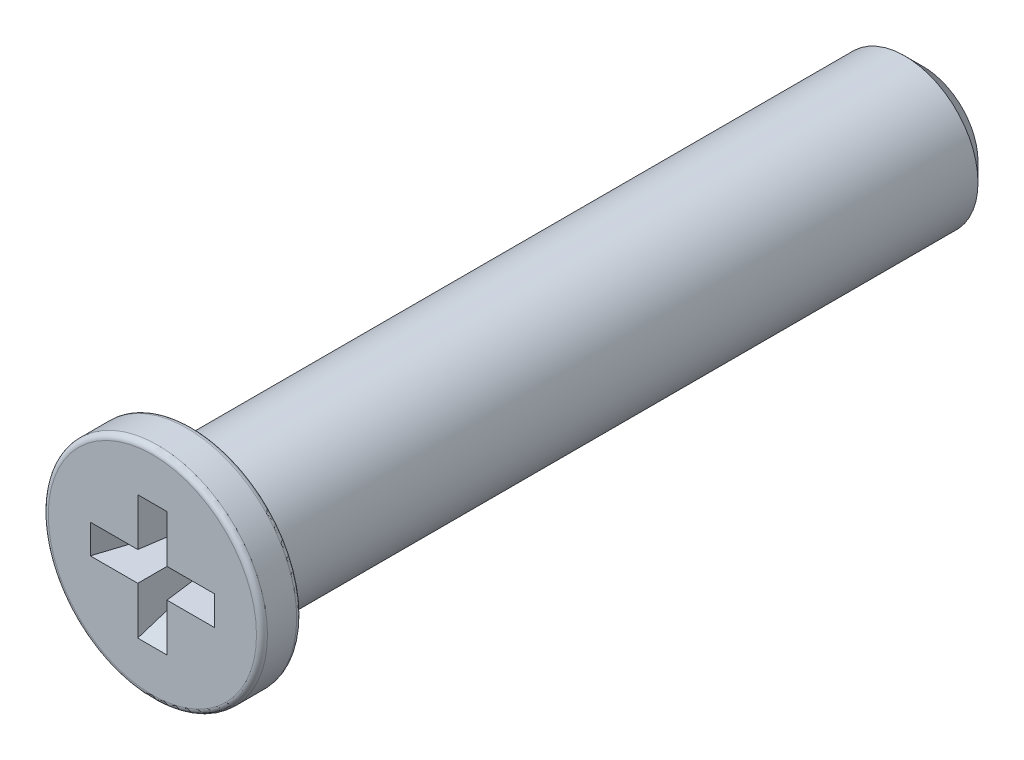
ISO-10303-21;
HEADER;
FILE_DESCRIPTION(('STEP AP214'),'2;1');
FILE_NAME('part.step','',(''),(''),'','','');
FILE_SCHEMA(('AUTOMOTIVE_DESIGN { 1 0 10303 214 1 1 1 1 }'));
ENDSEC;
DATA;
#1=APPLICATION_CONTEXT('core data for automotive mechanical design processes');
#2=APPLICATION_PROTOCOL_DEFINITION('international standard','automotive_design',2000,#1);
#3=PRODUCT_CONTEXT('',#1,'mechanical');
#4=PRODUCT('Part','Part','',(#3));
#5=PRODUCT_RELATED_PRODUCT_CATEGORY('part','',(#4));
#6=PRODUCT_DEFINITION_FORMATION('','',#4);
#7=PRODUCT_DEFINITION_CONTEXT('part definition',#1,'design');
#8=PRODUCT_DEFINITION('design','',#6,#7);
#9=PRODUCT_DEFINITION_SHAPE('','',#8);
#10=(LENGTH_UNIT() NAMED_UNIT(*) SI_UNIT(.MILLI.,.METRE.));
#11=(NAMED_UNIT(*) PLANE_ANGLE_UNIT() SI_UNIT($,.RADIAN.));
#12=(NAMED_UNIT(*) SI_UNIT($,.STERADIAN.) SOLID_ANGLE_UNIT());
#13=UNCERTAINTY_MEASURE_WITH_UNIT(LENGTH_MEASURE(1.E-05),#10,'distance_accuracy_value','');
#14=(GEOMETRIC_REPRESENTATION_CONTEXT(3) GLOBAL_UNCERTAINTY_ASSIGNED_CONTEXT((#13)) GLOBAL_UNIT_ASSIGNED_CONTEXT((#10,
#11,#12)) REPRESENTATION_CONTEXT('',''));
#15=CARTESIAN_POINT('',(0.,0.,0.));
#16=DIRECTION('',(0.,0.,1.));
#17=DIRECTION('',(1.,0.,0.));
#18=AXIS2_PLACEMENT_3D('',#15,#16,#17);
#19=CARTESIAN_POINT('',(-10.4,-11.25,7.5));
#20=DIRECTION('',(-0.923879532511287,0.,0.38268343236509));
#21=DIRECTION('',(0.38268343236509,0.,0.923879532511287));
#22=AXIS2_PLACEMENT_3D('',#19,#20,#21);
#23=PLANE('',#22);
#24=DIRECTION('',(0.,1.,0.));
#25=VECTOR('',#24,1.);
#26=CARTESIAN_POINT('',(-10.8970562748477,-11.25,6.30000000000001));
#27=LINE('',#26,#25);
#28=CARTESIAN_POINT('',(-10.8970562748477,-11.1339121743322,6.3));
#29=VERTEX_POINT('',#28);
#30=CARTESIAN_POINT('',(-10.8970562748477,-11.3660878256678,6.3));
#31=VERTEX_POINT('',#30);
#32=EDGE_CURVE('E117',#29,#31,#27,.F.);
#33=ORIENTED_EDGE('',*,*,#32,.T.);
#34=DIRECTION('',(-0.38188732625678,0.0644695530821727,-0.921957562347548));
#35=VECTOR('',#34,1.);
#36=CARTESIAN_POINT('',(-10.4,-11.45,7.5));
#37=LINE('',#36,#35);
#38=CARTESIAN_POINT('',(-10.4,-11.45,7.5));
#39=VERTEX_POINT('',#38);
#40=EDGE_CURVE('E133',#39,#31,#37,.T.);
#41=ORIENTED_EDGE('',*,*,#40,.F.);
#42=DIRECTION('',(0.,1.,0.));
#43=VECTOR('',#42,1.);
#44=CARTESIAN_POINT('',(-10.4,-11.25,7.5));
#45=LINE('',#44,#43);
#46=CARTESIAN_POINT('',(-10.4,-11.05,7.5));
#47=VERTEX_POINT('',#46);
#48=EDGE_CURVE('E122',#39,#47,#45,.T.);
#49=ORIENTED_EDGE('',*,*,#48,.T.);
#50=DIRECTION('',(0.38188732625678,0.064469553082174,0.921957562347548));
#51=VECTOR('',#50,1.);
#52=CARTESIAN_POINT('',(-10.8970562748477,-11.1339121743322,6.3));
#53=LINE('',#52,#51);
#54=EDGE_CURVE('E286',#29,#47,#53,.T.);
#55=ORIENTED_EDGE('',*,*,#54,.F.);
#56=EDGE_LOOP('',(#33,#41,#49,#55));
#57=FACE_BOUND('',#56,.T.);
#58=ADVANCED_FACE('F17',(#57),#23,.T.);
#59=CARTESIAN_POINT('',(-11.25,-11.45,7.5));
#60=DIRECTION('',(0.,0.997564050259824,0.0697564737441253));
#61=DIRECTION('',(0.,-0.0697564737441253,0.997564050259824));
#62=AXIS2_PLACEMENT_3D('',#59,#60,#61);
#63=PLANE('',#62);
#64=DIRECTION('',(1.,0.,0.));
#65=VECTOR('',#64,1.);
#66=CARTESIAN_POINT('',(-11.25,-11.3660878256678,6.3));
#67=LINE('',#66,#65);
#68=CARTESIAN_POINT('',(-11.1339121743322,-11.3660878256678,6.3));
#69=VERTEX_POINT('',#68);
#70=EDGE_CURVE('E135',#31,#69,#67,.F.);
#71=ORIENTED_EDGE('',*,*,#70,.T.);
#72=DIRECTION('',(-0.0695873743166644,0.0695873743166544,-0.995145815783509));
#73=VECTOR('',#72,1.);
#74=CARTESIAN_POINT('',(-11.05,-11.45,7.5));
#75=LINE('',#74,#73);
#76=CARTESIAN_POINT('',(-11.05,-11.45,7.5));
#77=VERTEX_POINT('',#76);
#78=EDGE_CURVE('E139',#77,#69,#75,.T.);
#79=ORIENTED_EDGE('',*,*,#78,.F.);
#80=DIRECTION('',(1.,0.,0.));
#81=VECTOR('',#80,1.);
#82=CARTESIAN_POINT('',(-11.25,-11.45,7.5));
#83=LINE('',#82,#81);
#84=EDGE_CURVE('E126',#77,#39,#83,.T.);
#85=ORIENTED_EDGE('',*,*,#84,.T.);
#86=ORIENTED_EDGE('',*,*,#40,.T.);
#87=EDGE_LOOP('',(#71,#79,#85,#86));
#88=FACE_BOUND('',#87,.T.);
#89=ADVANCED_FACE('F137',(#88),#63,.T.);
#90=CARTESIAN_POINT('',(-11.25,-11.05,7.5));
#91=DIRECTION('',(0.,-0.997564050259824,0.0697564737441253));
#92=DIRECTION('',(0.,-0.0697564737441253,-0.997564050259824));
#93=AXIS2_PLACEMENT_3D('',#90,#91,#92);
#94=PLANE('',#93);
#95=DIRECTION('',(1.,0.,0.));
#96=VECTOR('',#95,1.);
#97=CARTESIAN_POINT('',(-11.25,-11.1339121743322,6.3));
#98=LINE('',#97,#96);
#99=CARTESIAN_POINT('',(-11.1339121743322,-11.1339121743322,6.3));
#100=VERTEX_POINT('',#99);
#101=EDGE_CURVE('E288',#100,#29,#98,.T.);
#102=ORIENTED_EDGE('',*,*,#101,.T.);
#103=ORIENTED_EDGE('',*,*,#54,.T.);
#104=DIRECTION('',(1.,0.,0.));
#105=VECTOR('',#104,1.);
#106=CARTESIAN_POINT('',(-11.25,-11.05,7.5));
#107=LINE('',#106,#105);
#108=CARTESIAN_POINT('',(-11.05,-11.05,7.5));
#109=VERTEX_POINT('',#108);
#110=EDGE_CURVE('E129',#47,#109,#107,.F.);
#111=ORIENTED_EDGE('',*,*,#110,.T.);
#112=DIRECTION('',(0.0695873743166644,0.0695873743166544,0.995145815783509));
#113=VECTOR('',#112,1.);
#114=CARTESIAN_POINT('',(-11.1339121743322,-11.1339121743322,6.3));
#115=LINE('',#114,#113);
#116=EDGE_CURVE('E272',#100,#109,#115,.T.);
#117=ORIENTED_EDGE('',*,*,#116,.F.);
#118=EDGE_LOOP('',(#102,#103,#111,#117));
#119=FACE_BOUND('',#118,.T.);
#120=ADVANCED_FACE('F459',(#119),#94,.T.);
#121=CARTESIAN_POINT('',(-11.05,-11.25,7.5));
#122=DIRECTION('',(-0.997564050259824,0.,0.0697564737441253));
#123=DIRECTION('',(0.0697564737441253,0.,0.997564050259824));
#124=AXIS2_PLACEMENT_3D('',#121,#122,#123);
#125=PLANE('',#124);
#126=DIRECTION('',(0.,1.,0.));
#127=VECTOR('',#126,1.);
#128=CARTESIAN_POINT('',(-11.1339121743322,-11.25,6.3));
#129=LINE('',#128,#127);
#130=CARTESIAN_POINT('',(-11.1339121743322,-11.6029437251523,6.3));
#131=VERTEX_POINT('',#130);
#132=EDGE_CURVE('E281',#69,#131,#129,.F.);
#133=ORIENTED_EDGE('',*,*,#132,.T.);
#134=DIRECTION('',(-0.0644695530821646,0.381887326256791,-0.921957562347544));
#135=VECTOR('',#134,1.);
#136=CARTESIAN_POINT('',(-11.05,-12.1,7.5));
#137=LINE('',#136,#135);
#138=CARTESIAN_POINT('',(-11.05,-12.1,7.5));
#139=VERTEX_POINT('',#138);
#140=EDGE_CURVE('E266',#139,#131,#137,.T.);
#141=ORIENTED_EDGE('',*,*,#140,.F.);
#142=DIRECTION('',(0.,1.,0.));
#143=VECTOR('',#142,1.);
#144=CARTESIAN_POINT('',(-11.05,-11.25,7.5));
#145=LINE('',#144,#143);
#146=EDGE_CURVE('E284',#139,#77,#145,.T.);
#147=ORIENTED_EDGE('',*,*,#146,.T.);
#148=ORIENTED_EDGE('',*,*,#78,.T.);
#149=EDGE_LOOP('',(#133,#141,#147,#148));
#150=FACE_BOUND('',#149,.T.);
#151=ADVANCED_FACE('F298',(#150),#125,.T.);
#152=CARTESIAN_POINT('',(-11.05,-11.25,7.5));
#153=DIRECTION('',(-0.997564050259824,0.,0.0697564737441253));
#154=DIRECTION('',(0.0697564737441253,0.,0.997564050259824));
#155=AXIS2_PLACEMENT_3D('',#152,#153,#154);
#156=PLANE('',#155);
#157=DIRECTION('',(0.,1.,0.));
#158=VECTOR('',#157,1.);
#159=CARTESIAN_POINT('',(-11.1339121743322,-11.25,6.3));
#160=LINE('',#159,#158);
#161=CARTESIAN_POINT('',(-11.1339121743322,-10.8970562748477,6.3));
#162=VERTEX_POINT('',#161);
#163=EDGE_CURVE('E275',#162,#100,#160,.F.);
#164=ORIENTED_EDGE('',*,*,#163,.T.);
#165=ORIENTED_EDGE('',*,*,#116,.T.);
#166=DIRECTION('',(0.,1.,0.));
#167=VECTOR('',#166,1.);
#168=CARTESIAN_POINT('',(-11.05,-11.25,7.5));
#169=LINE('',#168,#167);
#170=CARTESIAN_POINT('',(-11.05,-10.4,7.5));
#171=VERTEX_POINT('',#170);
#172=EDGE_CURVE('E278',#109,#171,#169,.T.);
#173=ORIENTED_EDGE('',*,*,#172,.T.);
#174=DIRECTION('',(0.0644695530821647,0.381887326256791,0.921957562347544));
#175=VECTOR('',#174,1.);
#176=CARTESIAN_POINT('',(-11.1339121743322,-10.8970562748477,6.30000000000001));
#177=LINE('',#176,#175);
#178=EDGE_CURVE('E255',#162,#171,#177,.T.);
#179=ORIENTED_EDGE('',*,*,#178,.F.);
#180=EDGE_LOOP('',(#164,#165,#173,#179));
#181=FACE_BOUND('',#180,.T.);
#182=ADVANCED_FACE('F445',(#181),#156,.T.);
#183=CARTESIAN_POINT('',(-11.25,-12.1,7.5));
#184=DIRECTION('',(0.,0.923879532511287,0.38268343236509));
#185=DIRECTION('',(0.,-0.38268343236509,0.923879532511287));
#186=AXIS2_PLACEMENT_3D('',#183,#184,#185);
#187=PLANE('',#186);
#188=DIRECTION('',(1.,0.,0.));
#189=VECTOR('',#188,1.);
#190=CARTESIAN_POINT('',(-11.25,-11.6029437251523,6.30000000000001));
#191=LINE('',#190,#189);
#192=CARTESIAN_POINT('',(-11.3660878256678,-11.6029437251523,6.3));
#193=VERTEX_POINT('',#192);
#194=EDGE_CURVE('E264',#131,#193,#191,.F.);
#195=ORIENTED_EDGE('',*,*,#194,.T.);
#196=DIRECTION('',(0.0644695530821726,0.381887326256782,-0.921957562347547));
#197=VECTOR('',#196,1.);
#198=CARTESIAN_POINT('',(-11.45,-12.1,7.5));
#199=LINE('',#198,#197);
#200=CARTESIAN_POINT('',(-11.45,-12.1,7.5));
#201=VERTEX_POINT('',#200);
#202=EDGE_CURVE('E249',#201,#193,#199,.T.);
#203=ORIENTED_EDGE('',*,*,#202,.F.);
#204=DIRECTION('',(1.,0.,0.));
#205=VECTOR('',#204,1.);
#206=CARTESIAN_POINT('',(-11.25,-12.1,7.5));
#207=LINE('',#206,#205);
#208=EDGE_CURVE('E269',#201,#139,#207,.T.);
#209=ORIENTED_EDGE('',*,*,#208,.T.);
#210=ORIENTED_EDGE('',*,*,#140,.T.);
#211=EDGE_LOOP('',(#195,#203,#209,#210));
#212=FACE_BOUND('',#211,.T.);
#213=ADVANCED_FACE('F302',(#212),#187,.T.);
#214=CARTESIAN_POINT('',(-11.25,-10.4,7.5));
#215=DIRECTION('',(0.,-0.923879532511287,0.38268343236509));
#216=DIRECTION('',(0.,-0.38268343236509,-0.923879532511287));
#217=AXIS2_PLACEMENT_3D('',#214,#215,#216);
#218=PLANE('',#217);
#219=DIRECTION('',(1.,0.,0.));
#220=VECTOR('',#219,1.);
#221=CARTESIAN_POINT('',(-11.25,-10.8970562748477,6.30000000000001));
#222=LINE('',#221,#220);
#223=CARTESIAN_POINT('',(-11.3660878256678,-10.8970562748477,6.3));
#224=VERTEX_POINT('',#223);
#225=EDGE_CURVE('E258',#224,#162,#222,.T.);
#226=ORIENTED_EDGE('',*,*,#225,.T.);
#227=ORIENTED_EDGE('',*,*,#178,.T.);
#228=DIRECTION('',(1.,0.,0.));
#229=VECTOR('',#228,1.);
#230=CARTESIAN_POINT('',(-11.25,-10.4,7.5));
#231=LINE('',#230,#229);
#232=CARTESIAN_POINT('',(-11.45,-10.4,7.5));
#233=VERTEX_POINT('',#232);
#234=EDGE_CURVE('E261',#171,#233,#231,.F.);
#235=ORIENTED_EDGE('',*,*,#234,.T.);
#236=DIRECTION('',(-0.064469553082174,0.38188732625678,0.921957562347548));
#237=VECTOR('',#236,1.);
#238=CARTESIAN_POINT('',(-11.3660878256678,-10.8970562748477,6.3));
#239=LINE('',#238,#237);
#240=EDGE_CURVE('E241',#224,#233,#239,.T.);
#241=ORIENTED_EDGE('',*,*,#240,.F.);
#242=EDGE_LOOP('',(#226,#227,#235,#241));
#243=FACE_BOUND('',#242,.T.);
#244=ADVANCED_FACE('F431',(#243),#218,.T.);
#245=CARTESIAN_POINT('',(-11.45,-11.25,7.5));
#246=DIRECTION('',(0.997564050259824,0.,0.0697564737441253));
#247=DIRECTION('',(0.0697564737441253,0.,-0.997564050259824));
#248=AXIS2_PLACEMENT_3D('',#245,#246,#247);
#249=PLANE('',#248);
#250=DIRECTION('',(0.,1.,0.));
#251=VECTOR('',#250,1.);
#252=CARTESIAN_POINT('',(-11.3660878256678,-11.25,6.3));
#253=LINE('',#252,#251);
#254=CARTESIAN_POINT('',(-11.3660878256678,-11.3660878256678,6.3));
#255=VERTEX_POINT('',#254);
#256=EDGE_CURVE('E247',#193,#255,#253,.T.);
#257=ORIENTED_EDGE('',*,*,#256,.T.);
#258=DIRECTION('',(0.0695873743166544,0.0695873743166644,-0.995145815783509));
#259=VECTOR('',#258,1.);
#260=CARTESIAN_POINT('',(-11.45,-11.45,7.5));
#261=LINE('',#260,#259);
#262=CARTESIAN_POINT('',(-11.45,-11.45,7.5));
#263=VERTEX_POINT('',#262);
#264=EDGE_CURVE('E235',#263,#255,#261,.T.);
#265=ORIENTED_EDGE('',*,*,#264,.F.);
#266=DIRECTION('',(0.,1.,0.));
#267=VECTOR('',#266,1.);
#268=CARTESIAN_POINT('',(-11.45,-11.25,7.5));
#269=LINE('',#268,#267);
#270=EDGE_CURVE('E252',#263,#201,#269,.F.);
#271=ORIENTED_EDGE('',*,*,#270,.T.);
#272=ORIENTED_EDGE('',*,*,#202,.T.);
#273=EDGE_LOOP('',(#257,#265,#271,#272));
#274=FACE_BOUND('',#273,.T.);
#275=ADVANCED_FACE('F304',(#274),#249,.T.);
#276=CARTESIAN_POINT('',(-11.45,-11.25,7.5));
#277=DIRECTION('',(0.997564050259824,0.,0.0697564737441253));
#278=DIRECTION('',(0.0697564737441253,0.,-0.997564050259824));
#279=AXIS2_PLACEMENT_3D('',#276,#277,#278);
#280=PLANE('',#279);
#281=DIRECTION('',(0.,1.,0.));
#282=VECTOR('',#281,1.);
#283=CARTESIAN_POINT('',(-11.3660878256678,-11.25,6.3));
#284=LINE('',#283,#282);
#285=CARTESIAN_POINT('',(-11.3660878256678,-11.1339121743322,6.3));
#286=VERTEX_POINT('',#285);
#287=EDGE_CURVE('E230',#224,#286,#284,.F.);
#288=ORIENTED_EDGE('',*,*,#287,.F.);
#289=ORIENTED_EDGE('',*,*,#240,.T.);
#290=DIRECTION('',(0.,1.,0.));
#291=VECTOR('',#290,1.);
#292=CARTESIAN_POINT('',(-11.45,-11.25,7.5));
#293=LINE('',#292,#291);
#294=CARTESIAN_POINT('',(-11.45,-11.05,7.5));
#295=VERTEX_POINT('',#294);
#296=EDGE_CURVE('E244',#233,#295,#293,.F.);
#297=ORIENTED_EDGE('',*,*,#296,.T.);
#298=DIRECTION('',(-0.0695873743166544,0.0695873743166644,0.995145815783509));
#299=VECTOR('',#298,1.);
#300=CARTESIAN_POINT('',(-11.3660878256678,-11.1339121743322,6.3));
#301=LINE('',#300,#299);
#302=EDGE_CURVE('E222',#286,#295,#301,.T.);
#303=ORIENTED_EDGE('',*,*,#302,.F.);
#304=EDGE_LOOP('',(#288,#289,#297,#303));
#305=FACE_BOUND('',#304,.T.);
#306=ADVANCED_FACE('F417',(#305),#280,.T.);
#307=CARTESIAN_POINT('',(-11.25,-11.45,7.5));
#308=DIRECTION('',(0.,0.997564050259824,0.0697564737441253));
#309=DIRECTION('',(0.,-0.0697564737441253,0.997564050259824));
#310=AXIS2_PLACEMENT_3D('',#307,#308,#309);
#311=PLANE('',#310);
#312=DIRECTION('',(1.,0.,0.));
#313=VECTOR('',#312,1.);
#314=CARTESIAN_POINT('',(-11.25,-11.3660878256678,6.3));
#315=LINE('',#314,#313);
#316=CARTESIAN_POINT('',(-11.6029437251523,-11.3660878256678,6.3));
#317=VERTEX_POINT('',#316);
#318=EDGE_CURVE('E232',#317,#255,#315,.T.);
#319=ORIENTED_EDGE('',*,*,#318,.F.);
#320=DIRECTION('',(0.381887326256791,0.0644695530821646,-0.921957562347544));
#321=VECTOR('',#320,1.);
#322=CARTESIAN_POINT('',(-12.1,-11.45,7.5));
#323=LINE('',#322,#321);
#324=CARTESIAN_POINT('',(-12.1,-11.45,7.5));
#325=VERTEX_POINT('',#324);
#326=EDGE_CURVE('E219',#325,#317,#323,.T.);
#327=ORIENTED_EDGE('',*,*,#326,.F.);
#328=DIRECTION('',(1.,0.,0.));
#329=VECTOR('',#328,1.);
#330=CARTESIAN_POINT('',(-11.25,-11.45,7.5));
#331=LINE('',#330,#329);
#332=EDGE_CURVE('E238',#325,#263,#331,.T.);
#333=ORIENTED_EDGE('',*,*,#332,.T.);
#334=ORIENTED_EDGE('',*,*,#264,.T.);
#335=EDGE_LOOP('',(#319,#327,#333,#334));
#336=FACE_BOUND('',#335,.T.);
#337=ADVANCED_FACE('F307',(#336),#311,.T.);
#338=CARTESIAN_POINT('',(-11.25,-11.25,6.3));
#339=DIRECTION('',(0.,0.,1.));
#340=DIRECTION('',(1.,0.,0.));
#341=AXIS2_PLACEMENT_3D('',#338,#339,#340);
#342=PLANE('',#341);
#343=ORIENTED_EDGE('',*,*,#225,.F.);
#344=ORIENTED_EDGE('',*,*,#287,.T.);
#345=DIRECTION('',(1.,0.,0.));
#346=VECTOR('',#345,1.);
#347=CARTESIAN_POINT('',(-11.25,-11.1339121743322,6.3));
#348=LINE('',#347,#346);
#349=CARTESIAN_POINT('',(-11.6029437251523,-11.1339121743322,6.3));
#350=VERTEX_POINT('',#349);
#351=EDGE_CURVE('E225',#350,#286,#348,.T.);
#352=ORIENTED_EDGE('',*,*,#351,.F.);
#353=DIRECTION('',(0.,1.,0.));
#354=VECTOR('',#353,1.);
#355=CARTESIAN_POINT('',(-11.6029437251523,-11.25,6.30000000000001));
#356=LINE('',#355,#354);
#357=EDGE_CURVE('E216',#317,#350,#356,.T.);
#358=ORIENTED_EDGE('',*,*,#357,.F.);
#359=ORIENTED_EDGE('',*,*,#318,.T.);
#360=ORIENTED_EDGE('',*,*,#256,.F.);
#361=ORIENTED_EDGE('',*,*,#194,.F.);
#362=ORIENTED_EDGE('',*,*,#132,.F.);
#363=ORIENTED_EDGE('',*,*,#70,.F.);
#364=ORIENTED_EDGE('',*,*,#32,.F.);
#365=ORIENTED_EDGE('',*,*,#101,.F.);
#366=ORIENTED_EDGE('',*,*,#163,.F.);
#367=EDGE_LOOP('',(#343,#344,#352,#358,#359,#360,#361,#362,#363,#364,#365,#366));
#368=FACE_BOUND('',#367,.T.);
#369=ADVANCED_FACE('F294',(#368),#342,.T.);
#370=CARTESIAN_POINT('',(-11.25,-11.05,7.5));
#371=DIRECTION('',(0.,-0.997564050259824,0.0697564737441253));
#372=DIRECTION('',(0.,-0.0697564737441253,-0.997564050259824));
#373=AXIS2_PLACEMENT_3D('',#370,#371,#372);
#374=PLANE('',#373);
#375=ORIENTED_EDGE('',*,*,#351,.T.);
#376=ORIENTED_EDGE('',*,*,#302,.T.);
#377=DIRECTION('',(1.,0.,0.));
#378=VECTOR('',#377,1.);
#379=CARTESIAN_POINT('',(-11.25,-11.05,7.5));
#380=LINE('',#379,#378);
#381=CARTESIAN_POINT('',(-12.1,-11.05,7.5));
#382=VERTEX_POINT('',#381);
#383=EDGE_CURVE('E228',#295,#382,#380,.F.);
#384=ORIENTED_EDGE('',*,*,#383,.T.);
#385=DIRECTION('',(-0.381887326256791,0.0644695530821646,0.921957562347544));
#386=VECTOR('',#385,1.);
#387=CARTESIAN_POINT('',(-11.6029437251523,-11.1339121743322,6.30000000000001));
#388=LINE('',#387,#386);
#389=EDGE_CURVE('E207',#350,#382,#388,.T.);
#390=ORIENTED_EDGE('',*,*,#389,.F.);
#391=EDGE_LOOP('',(#375,#376,#384,#390));
#392=FACE_BOUND('',#391,.T.);
#393=ADVANCED_FACE('F336',(#392),#374,.T.);
#394=CARTESIAN_POINT('',(-12.1,-11.25,7.5));
#395=DIRECTION('',(0.923879532511287,0.,0.38268343236509));
#396=DIRECTION('',(0.38268343236509,0.,-0.923879532511287));
#397=AXIS2_PLACEMENT_3D('',#394,#395,#396);
#398=PLANE('',#397);
#399=ORIENTED_EDGE('',*,*,#357,.T.);
#400=ORIENTED_EDGE('',*,*,#389,.T.);
#401=DIRECTION('',(0.,1.,0.));
#402=VECTOR('',#401,1.);
#403=CARTESIAN_POINT('',(-12.1,-11.25,7.5));
#404=LINE('',#403,#402);
#405=EDGE_CURVE('E215',#382,#325,#404,.F.);
#406=ORIENTED_EDGE('',*,*,#405,.T.);
#407=ORIENTED_EDGE('',*,*,#326,.T.);
#408=EDGE_LOOP('',(#399,#400,#406,#407));
#409=FACE_BOUND('',#408,.T.);
#410=ADVANCED_FACE('F331',(#409),#398,.T.);
#411=CARTESIAN_POINT('',(-11.25,-11.25,7.5));
#412=DIRECTION('',(0.,0.,-1.));
#413=DIRECTION('',(-1.,0.,0.));
#414=AXIS2_PLACEMENT_3D('',#411,#412,#413);
#415=PLANE('',#414);
#416=ORIENTED_EDGE('',*,*,#383,.F.);
#417=ORIENTED_EDGE('',*,*,#296,.F.);
#418=ORIENTED_EDGE('',*,*,#234,.F.);
#419=ORIENTED_EDGE('',*,*,#172,.F.);
#420=ORIENTED_EDGE('',*,*,#110,.F.);
#421=ORIENTED_EDGE('',*,*,#48,.F.);
#422=ORIENTED_EDGE('',*,*,#84,.F.);
#423=ORIENTED_EDGE('',*,*,#146,.F.);
#424=ORIENTED_EDGE('',*,*,#208,.F.);
#425=ORIENTED_EDGE('',*,*,#270,.F.);
#426=ORIENTED_EDGE('',*,*,#332,.F.);
#427=ORIENTED_EDGE('',*,*,#405,.F.);
#428=EDGE_LOOP('',(#416,#417,#418,#419,#420,#421,#422,#423,#424,#425,#426,#427));
#429=FACE_BOUND('',#428,.T.);
#430=CARTESIAN_POINT('',(-11.25,-11.25,7.5));
#431=DIRECTION('',(0.,0.,-1.));
#432=DIRECTION('',(-1.,0.,0.));
#433=AXIS2_PLACEMENT_3D('',#430,#431,#432);
#434=CIRCLE('',#433,1.425);
#435=CARTESIAN_POINT('',(-12.675,-11.25,7.5));
#436=VERTEX_POINT('',#435);
#437=CARTESIAN_POINT('',(-9.825,-11.25,7.5));
#438=VERTEX_POINT('',#437);
#439=EDGE_CURVE('E311',#436,#438,#434,.T.);
#440=ORIENTED_EDGE('',*,*,#439,.F.);
#441=CARTESIAN_POINT('',(-11.25,-11.25,7.5));
#442=DIRECTION('',(0.,0.,-1.));
#443=DIRECTION('',(1.,0.,0.));
#444=AXIS2_PLACEMENT_3D('',#441,#442,#443);
#445=CIRCLE('',#444,1.425);
#446=EDGE_CURVE('E187',#438,#436,#445,.T.);
#447=ORIENTED_EDGE('',*,*,#446,.F.);
#448=EDGE_LOOP('',(#440,#447));
#449=FACE_BOUND('',#448,.T.);
#450=ADVANCED_FACE('F123',(#429,#449),#415,.F.);
#451=CARTESIAN_POINT('',(-11.25,-11.25,7.425));
#452=DIRECTION('',(0.,0.,-1.));
#453=DIRECTION('',(-1.,0.,0.));
#454=AXIS2_PLACEMENT_3D('',#451,#452,#453);
#455=TOROIDAL_SURFACE('',#454,1.425,0.075);
#456=CARTESIAN_POINT('',(-11.25,-11.25,7.425));
#457=DIRECTION('',(0.,0.,1.));
#458=DIRECTION('',(1.,0.,0.));
#459=AXIS2_PLACEMENT_3D('',#456,#457,#458);
#460=CIRCLE('',#459,1.5);
#461=CARTESIAN_POINT('',(-9.75,-11.25,7.425));
#462=VERTEX_POINT('',#461);
#463=EDGE_CURVE('E184',#462,#462,#460,.F.);
#464=ORIENTED_EDGE('',*,*,#463,.F.);
#465=EDGE_LOOP('',(#464));
#466=FACE_BOUND('',#465,.T.);
#467=ORIENTED_EDGE('',*,*,#446,.T.);
#468=ORIENTED_EDGE('',*,*,#439,.T.);
#469=EDGE_LOOP('',(#467,#468));
#470=FACE_BOUND('',#469,.T.);
#471=ADVANCED_FACE('F191',(#466,#470),#455,.T.);
#472=CARTESIAN_POINT('',(-11.25,-11.25,6.95));
#473=DIRECTION('',(0.,0.,1.));
#474=DIRECTION('',(1.,0.,0.));
#475=AXIS2_PLACEMENT_3D('',#472,#473,#474);
#476=CYLINDRICAL_SURFACE('',#475,1.5);
#477=ORIENTED_EDGE('',*,*,#463,.T.);
#478=EDGE_LOOP('',(#477));
#479=FACE_BOUND('',#478,.T.);
#480=CARTESIAN_POINT('',(-11.25,-11.25,7.025));
#481=DIRECTION('',(0.,0.,-1.));
#482=DIRECTION('',(-1.,0.,0.));
#483=AXIS2_PLACEMENT_3D('',#480,#481,#482);
#484=CIRCLE('',#483,1.5);
#485=CARTESIAN_POINT('',(-12.75,-11.25,7.025));
#486=VERTEX_POINT('',#485);
#487=EDGE_CURVE('E149',#486,#486,#484,.T.);
#488=ORIENTED_EDGE('',*,*,#487,.F.);
#489=EDGE_LOOP('',(#488));
#490=FACE_BOUND('',#489,.T.);
#491=ADVANCED_FACE('F195',(#479,#490),#476,.T.);
#492=CARTESIAN_POINT('',(-11.25,-11.25,-3.05));
#493=DIRECTION('',(0.,0.,-1.));
#494=DIRECTION('',(-1.,0.,0.));
#495=AXIS2_PLACEMENT_3D('',#492,#493,#494);
#496=PLANE('',#495);
#497=CARTESIAN_POINT('',(-11.25,-11.25,-3.0500000000302));
#498=DIRECTION('',(0.,0.,1.));
#499=DIRECTION('',(1.,0.,0.));
#500=AXIS2_PLACEMENT_3D('',#497,#498,#499);
#501=CIRCLE('',#500,0.749999999907231);
#502=CARTESIAN_POINT('',(-10.5000000000928,-11.25,-3.0500000000302));
#503=VERTEX_POINT('',#502);
#504=EDGE_CURVE('E145',#503,#503,#501,.T.);
#505=ORIENTED_EDGE('',*,*,#504,.F.);
#506=EDGE_LOOP('',(#505));
#507=FACE_BOUND('',#506,.T.);
#508=ADVANCED_FACE('F166',(#507),#496,.T.);
#509=CARTESIAN_POINT('',(-11.25,-11.25,7.025));
#510=DIRECTION('',(0.,0.,-1.));
#511=DIRECTION('',(-1.,0.,0.));
#512=AXIS2_PLACEMENT_3D('',#509,#510,#511);
#513=TOROIDAL_SURFACE('',#512,1.425,0.075);
#514=CARTESIAN_POINT('',(-11.25,-11.25,6.95));
#515=DIRECTION('',(0.,0.,1.));
#516=DIRECTION('',(1.,0.,0.));
#517=AXIS2_PLACEMENT_3D('',#514,#515,#516);
#518=CIRCLE('',#517,1.425);
#519=CARTESIAN_POINT('',(-12.675,-11.25,6.95));
#520=VERTEX_POINT('',#519);
#521=CARTESIAN_POINT('',(-9.825,-11.25,6.95));
#522=VERTEX_POINT('',#521);
#523=EDGE_CURVE('E148',#520,#522,#518,.F.);
#524=ORIENTED_EDGE('',*,*,#523,.F.);
#525=CARTESIAN_POINT('',(-11.25,-11.25,6.95));
#526=DIRECTION('',(0.,0.,1.));
#527=DIRECTION('',(-1.,0.,0.));
#528=AXIS2_PLACEMENT_3D('',#525,#526,#527);
#529=CIRCLE('',#528,1.425);
#530=EDGE_CURVE('E36',#522,#520,#529,.F.);
#531=ORIENTED_EDGE('',*,*,#530,.F.);
#532=EDGE_LOOP('',(#524,#531));
#533=FACE_BOUND('',#532,.T.);
#534=ORIENTED_EDGE('',*,*,#487,.T.);
#535=EDGE_LOOP('',(#534));
#536=FACE_BOUND('',#535,.T.);
#537=ADVANCED_FACE('F154',(#533,#536),#513,.T.);
#538=CARTESIAN_POINT('',(-11.25,-11.25,-2.79999999980873));
#539=DIRECTION('',(0.,0.,1.));
#540=DIRECTION('',(1.,0.,0.));
#541=AXIS2_PLACEMENT_3D('',#538,#539,#540);
#542=CONICAL_SURFACE('',#541,0.999999999730789,0.78539816260164);
#543=ORIENTED_EDGE('',*,*,#504,.T.);
#544=EDGE_LOOP('',(#543));
#545=FACE_BOUND('',#544,.T.);
#546=CARTESIAN_POINT('',(-11.25,-11.25,-2.8));
#547=DIRECTION('',(0.,0.,1.));
#548=DIRECTION('',(1.,0.,0.));
#549=AXIS2_PLACEMENT_3D('',#546,#547,#548);
#550=CIRCLE('',#549,1.);
#551=CARTESIAN_POINT('',(-10.25,-11.25,-2.8));
#552=VERTEX_POINT('',#551);
#553=EDGE_CURVE('E28',#552,#552,#550,.T.);
#554=ORIENTED_EDGE('',*,*,#553,.F.);
#555=EDGE_LOOP('',(#554));
#556=FACE_BOUND('',#555,.T.);
#557=ADVANCED_FACE('F165',(#545,#556),#542,.T.);
#558=CARTESIAN_POINT('',(-11.25,-11.25,6.95));
#559=DIRECTION('',(0.,0.,-1.));
#560=DIRECTION('',(-1.,0.,0.));
#561=AXIS2_PLACEMENT_3D('',#558,#559,#560);
#562=PLANE('',#561);
#563=CARTESIAN_POINT('',(-11.25,-11.25,6.95));
#564=DIRECTION('',(0.,0.,1.));
#565=DIRECTION('',(1.,0.,0.));
#566=AXIS2_PLACEMENT_3D('',#563,#564,#565);
#567=CIRCLE('',#566,1.);
#568=CARTESIAN_POINT('',(-10.25,-11.25,6.95));
#569=VERTEX_POINT('',#568);
#570=EDGE_CURVE('E11',#569,#569,#567,.F.);
#571=ORIENTED_EDGE('',*,*,#570,.F.);
#572=EDGE_LOOP('',(#571));
#573=FACE_BOUND('',#572,.T.);
#574=ORIENTED_EDGE('',*,*,#523,.T.);
#575=ORIENTED_EDGE('',*,*,#530,.T.);
#576=EDGE_LOOP('',(#574,#575));
#577=FACE_BOUND('',#576,.T.);
#578=ADVANCED_FACE('F339',(#573,#577),#562,.T.);
#579=CARTESIAN_POINT('',(-11.25,-11.25,-3.05));
#580=DIRECTION('',(0.,0.,1.));
#581=DIRECTION('',(1.,0.,0.));
#582=AXIS2_PLACEMENT_3D('',#579,#580,#581);
#583=CYLINDRICAL_SURFACE('',#582,1.);
#584=ORIENTED_EDGE('',*,*,#553,.T.);
#585=EDGE_LOOP('',(#584));
#586=FACE_BOUND('',#585,.T.);
#587=ORIENTED_EDGE('',*,*,#570,.T.);
#588=EDGE_LOOP('',(#587));
#589=FACE_BOUND('',#588,.T.);
#590=ADVANCED_FACE('F337',(#586,#589),#583,.T.);
#591=CLOSED_SHELL('',(#58,#89,#120,#151,#182,#213,#244,#275,#306,#337,#369,#393,#410,#450,#471,
#491,#508,#537,#557,#578,#590));
#592=MANIFOLD_SOLID_BREP('B1',#591);
#593=ADVANCED_BREP_SHAPE_REPRESENTATION('',(#18,#592),#14);
#594=SHAPE_DEFINITION_REPRESENTATION(#9,#593);
ENDSEC;
END-ISO-10303-21;
